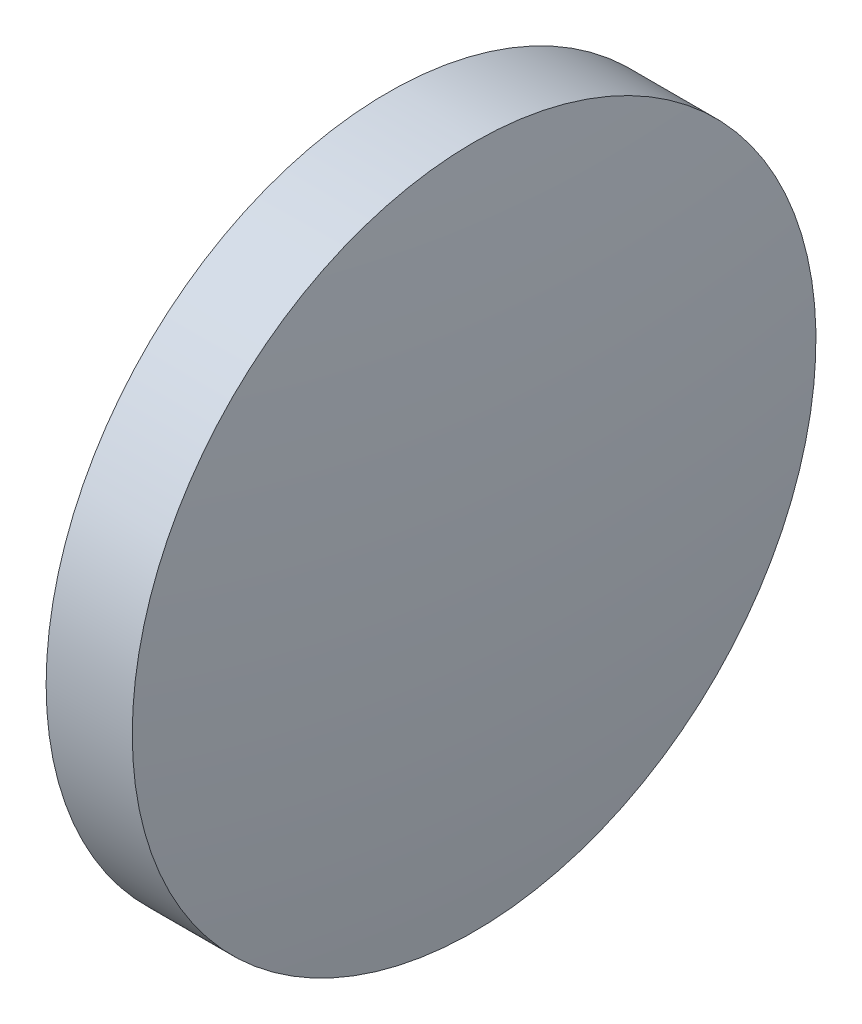
ISO-10303-21;
HEADER;
FILE_DESCRIPTION(('STEP AP214'),'2;1');
FILE_NAME('part.step','',(''),(''),'','','');
FILE_SCHEMA(('AUTOMOTIVE_DESIGN { 1 0 10303 214 1 1 1 1 }'));
ENDSEC;
DATA;
#1=APPLICATION_CONTEXT('core data for automotive mechanical design processes');
#2=APPLICATION_PROTOCOL_DEFINITION('international standard','automotive_design',2000,#1);
#3=PRODUCT_CONTEXT('',#1,'mechanical');
#4=PRODUCT('Part','Part','',(#3));
#5=PRODUCT_RELATED_PRODUCT_CATEGORY('part','',(#4));
#6=PRODUCT_DEFINITION_FORMATION('','',#4);
#7=PRODUCT_DEFINITION_CONTEXT('part definition',#1,'design');
#8=PRODUCT_DEFINITION('design','',#6,#7);
#9=PRODUCT_DEFINITION_SHAPE('','',#8);
#10=(LENGTH_UNIT() NAMED_UNIT(*) SI_UNIT(.MILLI.,.METRE.));
#11=(NAMED_UNIT(*) PLANE_ANGLE_UNIT() SI_UNIT($,.RADIAN.));
#12=(NAMED_UNIT(*) SI_UNIT($,.STERADIAN.) SOLID_ANGLE_UNIT());
#13=UNCERTAINTY_MEASURE_WITH_UNIT(LENGTH_MEASURE(1.E-05),#10,'distance_accuracy_value','');
#14=(GEOMETRIC_REPRESENTATION_CONTEXT(3) GLOBAL_UNCERTAINTY_ASSIGNED_CONTEXT((#13)) GLOBAL_UNIT_ASSIGNED_CONTEXT((#10,
#11,#12)) REPRESENTATION_CONTEXT('',''));
#15=CARTESIAN_POINT('',(0.,0.,0.));
#16=DIRECTION('',(0.,0.,1.));
#17=DIRECTION('',(1.,0.,0.));
#18=AXIS2_PLACEMENT_3D('',#15,#16,#17);
#19=CARTESIAN_POINT('',(382.214239015248,287.478678897806,0.));
#20=DIRECTION('',(-1.,0.,0.));
#21=DIRECTION('',(0.,1.,0.));
#22=AXIS2_PLACEMENT_3D('',#19,#20,#21);
#23=SPHERICAL_SURFACE('',#22,101.20625);
#24=CARTESIAN_POINT('',(482.620489015249,287.478678897806,0.));
#25=DIRECTION('',(-1.,0.,0.));
#26=DIRECTION('',(0.,0.,1.));
#27=AXIS2_PLACEMENT_3D('',#24,#25,#26);
#28=CIRCLE('',#27,12.7);
#29=CARTESIAN_POINT('',(482.620489015249,287.478678897806,12.7));
#30=VERTEX_POINT('',#29);
#31=EDGE_CURVE('E10',#30,#30,#28,.T.);
#32=ORIENTED_EDGE('',*,*,#31,.F.);
#33=EDGE_LOOP('',(#32));
#34=FACE_BOUND('',#33,.T.);
#35=ADVANCED_FACE('F35',(#34),#23,.T.);
#36=CARTESIAN_POINT('',(473.682270979573,287.478678897806,0.));
#37=DIRECTION('',(-1.,0.,0.));
#38=DIRECTION('',(0.,0.,1.));
#39=AXIS2_PLACEMENT_3D('',#36,#37,#38);
#40=CYLINDRICAL_SURFACE('',#39,12.7);
#41=CARTESIAN_POINT('',(479.420489015249,287.478678897806,0.));
#42=DIRECTION('',(-1.,0.,0.));
#43=DIRECTION('',(0.,0.,1.));
#44=AXIS2_PLACEMENT_3D('',#41,#42,#43);
#45=CIRCLE('',#44,12.7);
#46=CARTESIAN_POINT('',(479.420489015249,287.478678897806,12.7));
#47=VERTEX_POINT('',#46);
#48=EDGE_CURVE('E41',#47,#47,#45,.T.);
#49=ORIENTED_EDGE('',*,*,#48,.F.);
#50=EDGE_LOOP('',(#49));
#51=FACE_BOUND('',#50,.T.);
#52=ORIENTED_EDGE('',*,*,#31,.T.);
#53=EDGE_LOOP('',(#52));
#54=FACE_BOUND('',#53,.T.);
#55=ADVANCED_FACE('F49',(#51,#54),#40,.T.);
#56=CARTESIAN_POINT('',(479.420489015249,287.478678897806,0.));
#57=DIRECTION('',(1.,0.,0.));
#58=DIRECTION('',(0.,0.,-1.));
#59=AXIS2_PLACEMENT_3D('',#56,#57,#58);
#60=PLANE('',#59);
#61=ORIENTED_EDGE('',*,*,#48,.T.);
#62=EDGE_LOOP('',(#61));
#63=FACE_BOUND('',#62,.T.);
#64=ADVANCED_FACE('F47',(#63),#60,.F.);
#65=CLOSED_SHELL('',(#35,#55,#64));
#66=MANIFOLD_SOLID_BREP('B2',#65);
#67=ADVANCED_BREP_SHAPE_REPRESENTATION('',(#18,#66),#14);
#68=SHAPE_DEFINITION_REPRESENTATION(#9,#67);
ENDSEC;
END-ISO-10303-21;
